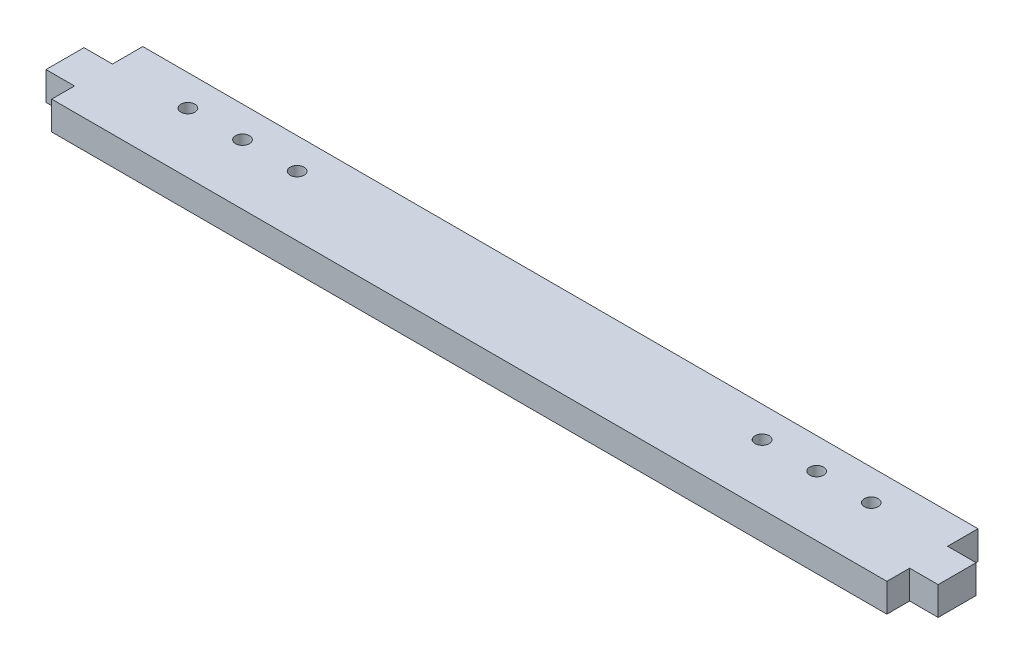
ISO-10303-21;
HEADER;
FILE_DESCRIPTION(('STEP AP214'),'2;1');
FILE_NAME('part.step','',(''),(''),'','','');
FILE_SCHEMA(('AUTOMOTIVE_DESIGN { 1 0 10303 214 1 1 1 1 }'));
ENDSEC;
DATA;
#1=APPLICATION_CONTEXT('core data for automotive mechanical design processes');
#2=APPLICATION_PROTOCOL_DEFINITION('international standard','automotive_design',2000,#1);
#3=PRODUCT_CONTEXT('',#1,'mechanical');
#4=PRODUCT('Part','Part','',(#3));
#5=PRODUCT_RELATED_PRODUCT_CATEGORY('part','',(#4));
#6=PRODUCT_DEFINITION_FORMATION('','',#4);
#7=PRODUCT_DEFINITION_CONTEXT('part definition',#1,'design');
#8=PRODUCT_DEFINITION('design','',#6,#7);
#9=PRODUCT_DEFINITION_SHAPE('','',#8);
#10=(LENGTH_UNIT() NAMED_UNIT(*) SI_UNIT(.MILLI.,.METRE.));
#11=(NAMED_UNIT(*) PLANE_ANGLE_UNIT() SI_UNIT($,.RADIAN.));
#12=(NAMED_UNIT(*) SI_UNIT($,.STERADIAN.) SOLID_ANGLE_UNIT());
#13=UNCERTAINTY_MEASURE_WITH_UNIT(LENGTH_MEASURE(1.E-05),#10,'distance_accuracy_value','');
#14=(GEOMETRIC_REPRESENTATION_CONTEXT(3) GLOBAL_UNCERTAINTY_ASSIGNED_CONTEXT((#13)) GLOBAL_UNIT_ASSIGNED_CONTEXT((#10,
#11,#12)) REPRESENTATION_CONTEXT('',''));
#15=CARTESIAN_POINT('',(0.,0.,0.));
#16=DIRECTION('',(0.,0.,1.));
#17=DIRECTION('',(1.,0.,0.));
#18=AXIS2_PLACEMENT_3D('',#15,#16,#17);
#19=CARTESIAN_POINT('',(-139.7,9.525,15.24));
#20=DIRECTION('',(1.,0.,0.));
#21=DIRECTION('',(0.,0.,-1.));
#22=AXIS2_PLACEMENT_3D('',#19,#20,#21);
#23=PLANE('',#22);
#24=DIRECTION('',(0.,0.,1.));
#25=VECTOR('',#24,1.);
#26=CARTESIAN_POINT('',(-139.7,9.525,15.24));
#27=LINE('',#26,#25);
#28=CARTESIAN_POINT('',(-139.7,9.525,7.61999999999998));
#29=VERTEX_POINT('',#28);
#30=CARTESIAN_POINT('',(-139.7,9.525,15.24));
#31=VERTEX_POINT('',#30);
#32=EDGE_CURVE('E221',#29,#31,#27,.T.);
#33=ORIENTED_EDGE('',*,*,#32,.F.);
#34=DIRECTION('',(0.,-1.,0.));
#35=VECTOR('',#34,1.);
#36=CARTESIAN_POINT('',(-139.7,0.,7.61999999999998));
#37=LINE('',#36,#35);
#38=CARTESIAN_POINT('',(-139.7,0.,7.61999999999998));
#39=VERTEX_POINT('',#38);
#40=EDGE_CURVE('E141',#29,#39,#37,.T.);
#41=ORIENTED_EDGE('',*,*,#40,.T.);
#42=DIRECTION('',(0.,0.,1.));
#43=VECTOR('',#42,1.);
#44=CARTESIAN_POINT('',(-139.7,0.,15.24));
#45=LINE('',#44,#43);
#46=CARTESIAN_POINT('',(-139.7,0.,15.24));
#47=VERTEX_POINT('',#46);
#48=EDGE_CURVE('E216',#39,#47,#45,.T.);
#49=ORIENTED_EDGE('',*,*,#48,.T.);
#50=DIRECTION('',(0.,-1.,0.));
#51=VECTOR('',#50,1.);
#52=CARTESIAN_POINT('',(-139.7,9.525,15.24));
#53=LINE('',#52,#51);
#54=EDGE_CURVE('E11',#31,#47,#53,.T.);
#55=ORIENTED_EDGE('',*,*,#54,.F.);
#56=EDGE_LOOP('',(#33,#41,#49,#55));
#57=FACE_BOUND('',#56,.T.);
#58=ADVANCED_FACE('F43',(#57),#23,.F.);
#59=CARTESIAN_POINT('',(139.7,9.525,15.24));
#60=DIRECTION('',(-1.,0.,0.));
#61=DIRECTION('',(0.,0.,1.));
#62=AXIS2_PLACEMENT_3D('',#59,#60,#61);
#63=PLANE('',#62);
#64=DIRECTION('',(0.,-1.,0.));
#65=VECTOR('',#64,1.);
#66=CARTESIAN_POINT('',(139.7,0.,7.61999999999998));
#67=LINE('',#66,#65);
#68=CARTESIAN_POINT('',(139.7,9.525,7.61999999999999));
#69=VERTEX_POINT('',#68);
#70=CARTESIAN_POINT('',(139.7,0.,7.61999999999999));
#71=VERTEX_POINT('',#70);
#72=EDGE_CURVE('E67',#69,#71,#67,.T.);
#73=ORIENTED_EDGE('',*,*,#72,.F.);
#74=DIRECTION('',(0.,0.,-1.));
#75=VECTOR('',#74,1.);
#76=CARTESIAN_POINT('',(139.7,9.525,15.24));
#77=LINE('',#76,#75);
#78=CARTESIAN_POINT('',(139.7,9.525,15.24));
#79=VERTEX_POINT('',#78);
#80=EDGE_CURVE('E225',#79,#69,#77,.T.);
#81=ORIENTED_EDGE('',*,*,#80,.F.);
#82=DIRECTION('',(0.,-1.,0.));
#83=VECTOR('',#82,1.);
#84=CARTESIAN_POINT('',(139.7,9.525,15.24));
#85=LINE('',#84,#83);
#86=CARTESIAN_POINT('',(139.7,0.,15.24));
#87=VERTEX_POINT('',#86);
#88=EDGE_CURVE('E52',#79,#87,#85,.T.);
#89=ORIENTED_EDGE('',*,*,#88,.T.);
#90=DIRECTION('',(0.,0.,-1.));
#91=VECTOR('',#90,1.);
#92=CARTESIAN_POINT('',(139.7,0.,15.24));
#93=LINE('',#92,#91);
#94=EDGE_CURVE('E240',#87,#71,#93,.T.);
#95=ORIENTED_EDGE('',*,*,#94,.T.);
#96=EDGE_LOOP('',(#73,#81,#89,#95));
#97=FACE_BOUND('',#96,.T.);
#98=ADVANCED_FACE('F256',(#97),#63,.F.);
#99=DIRECTION('',(0.,1.,0.));
#100=VECTOR('',#99,1.);
#101=CARTESIAN_POINT('',(139.7,0.,-5.08000000000002));
#102=LINE('',#101,#100);
#103=CARTESIAN_POINT('',(139.7,0.,-5.08000000000001));
#104=VERTEX_POINT('',#103);
#105=CARTESIAN_POINT('',(139.7,9.525,-5.08000000000002));
#106=VERTEX_POINT('',#105);
#107=EDGE_CURVE('E186',#104,#106,#102,.T.);
#108=ORIENTED_EDGE('',*,*,#107,.F.);
#109=CARTESIAN_POINT('',(139.7,0.,-15.24));
#110=VERTEX_POINT('',#109);
#111=EDGE_CURVE('E239',#104,#110,#93,.T.);
#112=ORIENTED_EDGE('',*,*,#111,.T.);
#113=DIRECTION('',(0.,-1.,0.));
#114=VECTOR('',#113,1.);
#115=CARTESIAN_POINT('',(139.7,9.525,-15.24));
#116=LINE('',#115,#114);
#117=CARTESIAN_POINT('',(139.7,9.525,-15.24));
#118=VERTEX_POINT('',#117);
#119=EDGE_CURVE('E249',#118,#110,#116,.T.);
#120=ORIENTED_EDGE('',*,*,#119,.F.);
#121=EDGE_CURVE('E224',#106,#118,#77,.T.);
#122=ORIENTED_EDGE('',*,*,#121,.F.);
#123=EDGE_LOOP('',(#108,#112,#120,#122));
#124=FACE_BOUND('',#123,.T.);
#125=ADVANCED_FACE('F283',(#124),#63,.F.);
#126=CARTESIAN_POINT('',(-139.7,0.,-15.24));
#127=VERTEX_POINT('',#126);
#128=CARTESIAN_POINT('',(-139.7,0.,-5.08000000000002));
#129=VERTEX_POINT('',#128);
#130=EDGE_CURVE('E232',#127,#129,#45,.T.);
#131=ORIENTED_EDGE('',*,*,#130,.T.);
#132=DIRECTION('',(0.,1.,0.));
#133=VECTOR('',#132,1.);
#134=CARTESIAN_POINT('',(-139.7,0.,-5.08000000000002));
#135=LINE('',#134,#133);
#136=CARTESIAN_POINT('',(-139.7,9.525,-5.08000000000001));
#137=VERTEX_POINT('',#136);
#138=EDGE_CURVE('E155',#129,#137,#135,.T.);
#139=ORIENTED_EDGE('',*,*,#138,.T.);
#140=CARTESIAN_POINT('',(-139.7,9.525,-15.24));
#141=VERTEX_POINT('',#140);
#142=EDGE_CURVE('E217',#141,#137,#27,.T.);
#143=ORIENTED_EDGE('',*,*,#142,.F.);
#144=DIRECTION('',(0.,-1.,0.));
#145=VECTOR('',#144,1.);
#146=CARTESIAN_POINT('',(-139.7,9.525,-15.24));
#147=LINE('',#146,#145);
#148=EDGE_CURVE('E231',#141,#127,#147,.T.);
#149=ORIENTED_EDGE('',*,*,#148,.T.);
#150=EDGE_LOOP('',(#131,#139,#143,#149));
#151=FACE_BOUND('',#150,.T.);
#152=ADVANCED_FACE('F45',(#151),#23,.F.);
#153=CARTESIAN_POINT('',(139.7,9.525,15.24));
#154=DIRECTION('',(0.,0.,-1.));
#155=DIRECTION('',(-1.,0.,0.));
#156=AXIS2_PLACEMENT_3D('',#153,#154,#155);
#157=PLANE('',#156);
#158=DIRECTION('',(1.,0.,0.));
#159=VECTOR('',#158,1.);
#160=CARTESIAN_POINT('',(139.7,0.,15.24));
#161=LINE('',#160,#159);
#162=EDGE_CURVE('E236',#47,#87,#161,.T.);
#163=ORIENTED_EDGE('',*,*,#162,.T.);
#164=ORIENTED_EDGE('',*,*,#88,.F.);
#165=DIRECTION('',(1.,0.,0.));
#166=VECTOR('',#165,1.);
#167=CARTESIAN_POINT('',(139.7,9.525,15.24));
#168=LINE('',#167,#166);
#169=EDGE_CURVE('E220',#31,#79,#168,.T.);
#170=ORIENTED_EDGE('',*,*,#169,.F.);
#171=ORIENTED_EDGE('',*,*,#54,.T.);
#172=EDGE_LOOP('',(#163,#164,#170,#171));
#173=FACE_BOUND('',#172,.T.);
#174=ADVANCED_FACE('F272',(#173),#157,.F.);
#175=CARTESIAN_POINT('',(139.7,9.525,-15.24));
#176=DIRECTION('',(0.,0.,1.));
#177=DIRECTION('',(1.,0.,0.));
#178=AXIS2_PLACEMENT_3D('',#175,#176,#177);
#179=PLANE('',#178);
#180=DIRECTION('',(-1.,0.,0.));
#181=VECTOR('',#180,1.);
#182=CARTESIAN_POINT('',(139.7,0.,-15.24));
#183=LINE('',#182,#181);
#184=EDGE_CURVE('E243',#110,#127,#183,.T.);
#185=ORIENTED_EDGE('',*,*,#184,.T.);
#186=ORIENTED_EDGE('',*,*,#148,.F.);
#187=DIRECTION('',(-1.,0.,0.));
#188=VECTOR('',#187,1.);
#189=CARTESIAN_POINT('',(139.7,9.525,-15.24));
#190=LINE('',#189,#188);
#191=EDGE_CURVE('E228',#118,#141,#190,.T.);
#192=ORIENTED_EDGE('',*,*,#191,.F.);
#193=ORIENTED_EDGE('',*,*,#119,.T.);
#194=EDGE_LOOP('',(#185,#186,#192,#193));
#195=FACE_BOUND('',#194,.T.);
#196=ADVANCED_FACE('F287',(#195),#179,.F.);
#197=CARTESIAN_POINT('',(0.,9.525,0.));
#198=DIRECTION('',(0.,1.,0.));
#199=DIRECTION('',(0.,0.,1.));
#200=AXIS2_PLACEMENT_3D('',#197,#198,#199);
#201=PLANE('',#200);
#202=CARTESIAN_POINT('',(-114.3,9.525,-4.92760000000002));
#203=DIRECTION('',(0.,1.,0.));
#204=DIRECTION('',(0.,0.,-1.));
#205=AXIS2_PLACEMENT_3D('',#202,#203,#204);
#206=CIRCLE('',#205,2.3368);
#207=CARTESIAN_POINT('',(-114.3,9.525,-7.26440000000002));
#208=VERTEX_POINT('',#207);
#209=EDGE_CURVE('E469',#208,#208,#206,.T.);
#210=ORIENTED_EDGE('',*,*,#209,.F.);
#211=EDGE_LOOP('',(#210));
#212=FACE_BOUND('',#211,.T.);
#213=CARTESIAN_POINT('',(-77.7748,9.525,-4.92760000000002));
#214=DIRECTION('',(0.,1.,0.));
#215=DIRECTION('',(0.,0.,-1.));
#216=AXIS2_PLACEMENT_3D('',#213,#214,#215);
#217=CIRCLE('',#216,2.3368);
#218=CARTESIAN_POINT('',(-77.7748,9.525,-7.26440000000002));
#219=VERTEX_POINT('',#218);
#220=EDGE_CURVE('E474',#219,#219,#217,.T.);
#221=ORIENTED_EDGE('',*,*,#220,.F.);
#222=EDGE_LOOP('',(#221));
#223=FACE_BOUND('',#222,.T.);
#224=CARTESIAN_POINT('',(-96.0374,9.525,-4.92760000000002));
#225=DIRECTION('',(0.,1.,0.));
#226=DIRECTION('',(0.,0.,-1.));
#227=AXIS2_PLACEMENT_3D('',#224,#225,#226);
#228=CIRCLE('',#227,2.3368);
#229=CARTESIAN_POINT('',(-96.0374,9.525,-7.26440000000002));
#230=VERTEX_POINT('',#229);
#231=EDGE_CURVE('E487',#230,#230,#228,.T.);
#232=ORIENTED_EDGE('',*,*,#231,.F.);
#233=EDGE_LOOP('',(#232));
#234=FACE_BOUND('',#233,.T.);
#235=CARTESIAN_POINT('',(114.3,9.525,-4.92760000000002));
#236=DIRECTION('',(0.,-1.,0.));
#237=DIRECTION('',(0.,0.,-1.));
#238=AXIS2_PLACEMENT_3D('',#235,#236,#237);
#239=CIRCLE('',#238,2.3368);
#240=CARTESIAN_POINT('',(114.3,9.525,-7.26440000000002));
#241=VERTEX_POINT('',#240);
#242=EDGE_CURVE('E171',#241,#241,#239,.T.);
#243=ORIENTED_EDGE('',*,*,#242,.T.);
#244=EDGE_LOOP('',(#243));
#245=FACE_BOUND('',#244,.T.);
#246=CARTESIAN_POINT('',(77.7748,9.525,-4.92760000000002));
#247=DIRECTION('',(0.,-1.,0.));
#248=DIRECTION('',(0.,0.,-1.));
#249=AXIS2_PLACEMENT_3D('',#246,#247,#248);
#250=CIRCLE('',#249,2.3368);
#251=CARTESIAN_POINT('',(77.7748,9.525,-7.26440000000002));
#252=VERTEX_POINT('',#251);
#253=EDGE_CURVE('E506',#252,#252,#250,.T.);
#254=ORIENTED_EDGE('',*,*,#253,.T.);
#255=EDGE_LOOP('',(#254));
#256=FACE_BOUND('',#255,.T.);
#257=CARTESIAN_POINT('',(96.0374,9.525,-4.92760000000002));
#258=DIRECTION('',(0.,-1.,0.));
#259=DIRECTION('',(0.,0.,-1.));
#260=AXIS2_PLACEMENT_3D('',#257,#258,#259);
#261=CIRCLE('',#260,2.3368);
#262=CARTESIAN_POINT('',(96.0374,9.525,-7.26440000000002));
#263=VERTEX_POINT('',#262);
#264=EDGE_CURVE('E478',#263,#263,#261,.T.);
#265=ORIENTED_EDGE('',*,*,#264,.T.);
#266=EDGE_LOOP('',(#265));
#267=FACE_BOUND('',#266,.T.);
#268=ORIENTED_EDGE('',*,*,#142,.T.);
#269=DIRECTION('',(1.,0.,0.));
#270=VECTOR('',#269,1.);
#271=CARTESIAN_POINT('',(-149.225,9.525,-5.08000000000002));
#272=LINE('',#271,#270);
#273=CARTESIAN_POINT('',(-149.225,9.525,-5.08000000000002));
#274=VERTEX_POINT('',#273);
#275=EDGE_CURVE('E59',#274,#137,#272,.T.);
#276=ORIENTED_EDGE('',*,*,#275,.F.);
#277=DIRECTION('',(0.,0.,1.));
#278=VECTOR('',#277,1.);
#279=CARTESIAN_POINT('',(-149.225,9.525,7.61999999999998));
#280=LINE('',#279,#278);
#281=CARTESIAN_POINT('',(-149.225,9.525,7.61999999999998));
#282=VERTEX_POINT('',#281);
#283=EDGE_CURVE('E151',#274,#282,#280,.T.);
#284=ORIENTED_EDGE('',*,*,#283,.T.);
#285=DIRECTION('',(1.,0.,0.));
#286=VECTOR('',#285,1.);
#287=CARTESIAN_POINT('',(-149.225,9.525,7.61999999999998));
#288=LINE('',#287,#286);
#289=EDGE_CURVE('E135',#282,#29,#288,.T.);
#290=ORIENTED_EDGE('',*,*,#289,.T.);
#291=ORIENTED_EDGE('',*,*,#32,.T.);
#292=ORIENTED_EDGE('',*,*,#169,.T.);
#293=ORIENTED_EDGE('',*,*,#80,.T.);
#294=DIRECTION('',(-1.,0.,0.));
#295=VECTOR('',#294,1.);
#296=CARTESIAN_POINT('',(149.225,9.525,7.61999999999998));
#297=LINE('',#296,#295);
#298=CARTESIAN_POINT('',(149.225,9.525,7.61999999999998));
#299=VERTEX_POINT('',#298);
#300=EDGE_CURVE('E195',#299,#69,#297,.T.);
#301=ORIENTED_EDGE('',*,*,#300,.F.);
#302=DIRECTION('',(0.,0.,1.));
#303=VECTOR('',#302,1.);
#304=CARTESIAN_POINT('',(149.225,9.525,7.61999999999998));
#305=LINE('',#304,#303);
#306=CARTESIAN_POINT('',(149.225,9.525,-5.08000000000002));
#307=VERTEX_POINT('',#306);
#308=EDGE_CURVE('E192',#307,#299,#305,.T.);
#309=ORIENTED_EDGE('',*,*,#308,.F.);
#310=DIRECTION('',(-1.,0.,0.));
#311=VECTOR('',#310,1.);
#312=CARTESIAN_POINT('',(149.225,9.525,-5.08000000000002));
#313=LINE('',#312,#311);
#314=EDGE_CURVE('E204',#307,#106,#313,.T.);
#315=ORIENTED_EDGE('',*,*,#314,.T.);
#316=ORIENTED_EDGE('',*,*,#121,.T.);
#317=ORIENTED_EDGE('',*,*,#191,.T.);
#318=EDGE_LOOP('',(#268,#276,#284,#290,#291,#292,#293,#301,#309,#315,#316,#317));
#319=FACE_BOUND('',#318,.T.);
#320=ADVANCED_FACE('F158',(#212,#223,#234,#245,#256,#267,#319),#201,.T.);
#321=CARTESIAN_POINT('',(0.,0.,0.));
#322=DIRECTION('',(0.,1.,0.));
#323=DIRECTION('',(0.,0.,1.));
#324=AXIS2_PLACEMENT_3D('',#321,#322,#323);
#325=PLANE('',#324);
#326=CARTESIAN_POINT('',(-114.3,0.,-4.92760000000002));
#327=DIRECTION('',(0.,1.,0.));
#328=DIRECTION('',(0.,0.,-1.));
#329=AXIS2_PLACEMENT_3D('',#326,#327,#328);
#330=CIRCLE('',#329,2.3368);
#331=CARTESIAN_POINT('',(-114.3,0.,-7.26440000000002));
#332=VERTEX_POINT('',#331);
#333=EDGE_CURVE('E472',#332,#332,#330,.T.);
#334=ORIENTED_EDGE('',*,*,#333,.T.);
#335=EDGE_LOOP('',(#334));
#336=FACE_BOUND('',#335,.T.);
#337=CARTESIAN_POINT('',(-77.7748,0.,-4.92760000000002));
#338=DIRECTION('',(0.,1.,0.));
#339=DIRECTION('',(0.,0.,-1.));
#340=AXIS2_PLACEMENT_3D('',#337,#338,#339);
#341=CIRCLE('',#340,2.3368);
#342=CARTESIAN_POINT('',(-77.7748,0.,-7.26440000000002));
#343=VERTEX_POINT('',#342);
#344=EDGE_CURVE('E481',#343,#343,#341,.T.);
#345=ORIENTED_EDGE('',*,*,#344,.T.);
#346=EDGE_LOOP('',(#345));
#347=FACE_BOUND('',#346,.T.);
#348=CARTESIAN_POINT('',(-96.0374,0.,-4.92760000000002));
#349=DIRECTION('',(0.,1.,0.));
#350=DIRECTION('',(0.,0.,-1.));
#351=AXIS2_PLACEMENT_3D('',#348,#349,#350);
#352=CIRCLE('',#351,2.3368);
#353=CARTESIAN_POINT('',(-96.0374,0.,-7.26440000000002));
#354=VERTEX_POINT('',#353);
#355=EDGE_CURVE('E491',#354,#354,#352,.T.);
#356=ORIENTED_EDGE('',*,*,#355,.T.);
#357=EDGE_LOOP('',(#356));
#358=FACE_BOUND('',#357,.T.);
#359=CARTESIAN_POINT('',(114.3,0.,-4.92760000000002));
#360=DIRECTION('',(0.,-1.,0.));
#361=DIRECTION('',(0.,0.,-1.));
#362=AXIS2_PLACEMENT_3D('',#359,#360,#361);
#363=CIRCLE('',#362,2.3368);
#364=CARTESIAN_POINT('',(114.3,0.,-7.26440000000002));
#365=VERTEX_POINT('',#364);
#366=EDGE_CURVE('E498',#365,#365,#363,.T.);
#367=ORIENTED_EDGE('',*,*,#366,.F.);
#368=EDGE_LOOP('',(#367));
#369=FACE_BOUND('',#368,.T.);
#370=CARTESIAN_POINT('',(77.7748,0.,-4.92760000000002));
#371=DIRECTION('',(0.,-1.,0.));
#372=DIRECTION('',(0.,0.,-1.));
#373=AXIS2_PLACEMENT_3D('',#370,#371,#372);
#374=CIRCLE('',#373,2.3368);
#375=CARTESIAN_POINT('',(77.7748,0.,-7.26440000000002));
#376=VERTEX_POINT('',#375);
#377=EDGE_CURVE('E502',#376,#376,#374,.T.);
#378=ORIENTED_EDGE('',*,*,#377,.F.);
#379=EDGE_LOOP('',(#378));
#380=FACE_BOUND('',#379,.T.);
#381=CARTESIAN_POINT('',(96.0374,0.,-4.92760000000002));
#382=DIRECTION('',(0.,-1.,0.));
#383=DIRECTION('',(0.,0.,-1.));
#384=AXIS2_PLACEMENT_3D('',#381,#382,#383);
#385=CIRCLE('',#384,2.3368);
#386=CARTESIAN_POINT('',(96.0374,0.,-7.26440000000002));
#387=VERTEX_POINT('',#386);
#388=EDGE_CURVE('E510',#387,#387,#385,.T.);
#389=ORIENTED_EDGE('',*,*,#388,.F.);
#390=EDGE_LOOP('',(#389));
#391=FACE_BOUND('',#390,.T.);
#392=ORIENTED_EDGE('',*,*,#130,.F.);
#393=ORIENTED_EDGE('',*,*,#184,.F.);
#394=ORIENTED_EDGE('',*,*,#111,.F.);
#395=DIRECTION('',(-1.,0.,0.));
#396=VECTOR('',#395,1.);
#397=CARTESIAN_POINT('',(149.225,0.,-5.08000000000002));
#398=LINE('',#397,#396);
#399=CARTESIAN_POINT('',(149.225,0.,-5.08000000000002));
#400=VERTEX_POINT('',#399);
#401=EDGE_CURVE('E208',#400,#104,#398,.T.);
#402=ORIENTED_EDGE('',*,*,#401,.F.);
#403=DIRECTION('',(0.,0.,-1.));
#404=VECTOR('',#403,1.);
#405=CARTESIAN_POINT('',(149.225,0.,7.61999999999998));
#406=LINE('',#405,#404);
#407=CARTESIAN_POINT('',(149.225,0.,7.61999999999998));
#408=VERTEX_POINT('',#407);
#409=EDGE_CURVE('E185',#408,#400,#406,.T.);
#410=ORIENTED_EDGE('',*,*,#409,.F.);
#411=DIRECTION('',(-1.,0.,0.));
#412=VECTOR('',#411,1.);
#413=CARTESIAN_POINT('',(149.225,0.,7.61999999999998));
#414=LINE('',#413,#412);
#415=EDGE_CURVE('E212',#408,#71,#414,.T.);
#416=ORIENTED_EDGE('',*,*,#415,.T.);
#417=ORIENTED_EDGE('',*,*,#94,.F.);
#418=ORIENTED_EDGE('',*,*,#162,.F.);
#419=ORIENTED_EDGE('',*,*,#48,.F.);
#420=DIRECTION('',(1.,0.,0.));
#421=VECTOR('',#420,1.);
#422=CARTESIAN_POINT('',(-149.225,0.,7.61999999999998));
#423=LINE('',#422,#421);
#424=CARTESIAN_POINT('',(-149.225,0.,7.61999999999998));
#425=VERTEX_POINT('',#424);
#426=EDGE_CURVE('E168',#425,#39,#423,.T.);
#427=ORIENTED_EDGE('',*,*,#426,.F.);
#428=DIRECTION('',(0.,0.,-1.));
#429=VECTOR('',#428,1.);
#430=CARTESIAN_POINT('',(-149.225,0.,7.61999999999998));
#431=LINE('',#430,#429);
#432=CARTESIAN_POINT('',(-149.225,0.,-5.08000000000002));
#433=VERTEX_POINT('',#432);
#434=EDGE_CURVE('E153',#425,#433,#431,.T.);
#435=ORIENTED_EDGE('',*,*,#434,.T.);
#436=DIRECTION('',(1.,0.,0.));
#437=VECTOR('',#436,1.);
#438=CARTESIAN_POINT('',(-149.225,0.,-5.08000000000002));
#439=LINE('',#438,#437);
#440=EDGE_CURVE('E176',#433,#129,#439,.T.);
#441=ORIENTED_EDGE('',*,*,#440,.T.);
#442=EDGE_LOOP('',(#392,#393,#394,#402,#410,#416,#417,#418,#419,#427,#435,#441));
#443=FACE_BOUND('',#442,.T.);
#444=ADVANCED_FACE('F262',(#336,#347,#358,#369,#380,#391,#443),#325,.F.);
#445=CARTESIAN_POINT('',(149.225,0.,7.61999999999998));
#446=DIRECTION('',(0.,0.,-1.));
#447=DIRECTION('',(-1.,0.,0.));
#448=AXIS2_PLACEMENT_3D('',#445,#446,#447);
#449=PLANE('',#448);
#450=ORIENTED_EDGE('',*,*,#72,.T.);
#451=ORIENTED_EDGE('',*,*,#415,.F.);
#452=DIRECTION('',(0.,-1.,0.));
#453=VECTOR('',#452,1.);
#454=CARTESIAN_POINT('',(149.225,0.,7.61999999999998));
#455=LINE('',#454,#453);
#456=EDGE_CURVE('E181',#299,#408,#455,.T.);
#457=ORIENTED_EDGE('',*,*,#456,.F.);
#458=ORIENTED_EDGE('',*,*,#300,.T.);
#459=EDGE_LOOP('',(#450,#451,#457,#458));
#460=FACE_BOUND('',#459,.T.);
#461=ADVANCED_FACE('F268',(#460),#449,.F.);
#462=CARTESIAN_POINT('',(149.225,0.,-5.08000000000002));
#463=DIRECTION('',(0.,0.,1.));
#464=DIRECTION('',(0.,-1.,0.));
#465=AXIS2_PLACEMENT_3D('',#462,#463,#464);
#466=PLANE('',#465);
#467=ORIENTED_EDGE('',*,*,#107,.T.);
#468=ORIENTED_EDGE('',*,*,#314,.F.);
#469=DIRECTION('',(0.,1.,0.));
#470=VECTOR('',#469,1.);
#471=CARTESIAN_POINT('',(149.225,0.,-5.08000000000002));
#472=LINE('',#471,#470);
#473=EDGE_CURVE('E189',#400,#307,#472,.T.);
#474=ORIENTED_EDGE('',*,*,#473,.F.);
#475=ORIENTED_EDGE('',*,*,#401,.T.);
#476=EDGE_LOOP('',(#467,#468,#474,#475));
#477=FACE_BOUND('',#476,.T.);
#478=ADVANCED_FACE('F293',(#477),#466,.F.);
#479=CARTESIAN_POINT('',(149.225,0.,0.));
#480=DIRECTION('',(-1.,0.,0.));
#481=DIRECTION('',(0.,0.,1.));
#482=AXIS2_PLACEMENT_3D('',#479,#480,#481);
#483=PLANE('',#482);
#484=ORIENTED_EDGE('',*,*,#456,.T.);
#485=ORIENTED_EDGE('',*,*,#409,.T.);
#486=ORIENTED_EDGE('',*,*,#473,.T.);
#487=ORIENTED_EDGE('',*,*,#308,.T.);
#488=EDGE_LOOP('',(#484,#485,#486,#487));
#489=FACE_BOUND('',#488,.T.);
#490=ADVANCED_FACE('F295',(#489),#483,.F.);
#491=CARTESIAN_POINT('',(-149.225,0.,7.61999999999998));
#492=DIRECTION('',(0.,0.,1.));
#493=DIRECTION('',(1.,0.,0.));
#494=AXIS2_PLACEMENT_3D('',#491,#492,#493);
#495=PLANE('',#494);
#496=ORIENTED_EDGE('',*,*,#40,.F.);
#497=ORIENTED_EDGE('',*,*,#289,.F.);
#498=DIRECTION('',(0.,-1.,0.));
#499=VECTOR('',#498,1.);
#500=CARTESIAN_POINT('',(-149.225,0.,7.61999999999998));
#501=LINE('',#500,#499);
#502=EDGE_CURVE('E138',#282,#425,#501,.T.);
#503=ORIENTED_EDGE('',*,*,#502,.T.);
#504=ORIENTED_EDGE('',*,*,#426,.T.);
#505=EDGE_LOOP('',(#496,#497,#503,#504));
#506=FACE_BOUND('',#505,.T.);
#507=ADVANCED_FACE('F137',(#506),#495,.T.);
#508=CARTESIAN_POINT('',(-149.225,0.,-5.08000000000002));
#509=DIRECTION('',(0.,0.,-1.));
#510=DIRECTION('',(0.,1.,0.));
#511=AXIS2_PLACEMENT_3D('',#508,#509,#510);
#512=PLANE('',#511);
#513=ORIENTED_EDGE('',*,*,#138,.F.);
#514=ORIENTED_EDGE('',*,*,#440,.F.);
#515=DIRECTION('',(0.,1.,0.));
#516=VECTOR('',#515,1.);
#517=CARTESIAN_POINT('',(-149.225,0.,-5.08000000000002));
#518=LINE('',#517,#516);
#519=EDGE_CURVE('E160',#433,#274,#518,.T.);
#520=ORIENTED_EDGE('',*,*,#519,.T.);
#521=ORIENTED_EDGE('',*,*,#275,.T.);
#522=EDGE_LOOP('',(#513,#514,#520,#521));
#523=FACE_BOUND('',#522,.T.);
#524=ADVANCED_FACE('F290',(#523),#512,.T.);
#525=CARTESIAN_POINT('',(-149.225,0.,0.));
#526=DIRECTION('',(1.,0.,0.));
#527=DIRECTION('',(0.,0.,1.));
#528=AXIS2_PLACEMENT_3D('',#525,#526,#527);
#529=PLANE('',#528);
#530=ORIENTED_EDGE('',*,*,#502,.F.);
#531=ORIENTED_EDGE('',*,*,#283,.F.);
#532=ORIENTED_EDGE('',*,*,#519,.F.);
#533=ORIENTED_EDGE('',*,*,#434,.F.);
#534=EDGE_LOOP('',(#530,#531,#532,#533));
#535=FACE_BOUND('',#534,.T.);
#536=ADVANCED_FACE('F149',(#535),#529,.F.);
#537=CARTESIAN_POINT('',(96.0374,9.525,-4.92760000000002));
#538=DIRECTION('',(0.,-1.,0.));
#539=DIRECTION('',(0.,0.,-1.));
#540=AXIS2_PLACEMENT_3D('',#537,#538,#539);
#541=CYLINDRICAL_SURFACE('',#540,2.3368);
#542=ORIENTED_EDGE('',*,*,#264,.F.);
#543=EDGE_LOOP('',(#542));
#544=FACE_BOUND('',#543,.T.);
#545=ORIENTED_EDGE('',*,*,#388,.T.);
#546=EDGE_LOOP('',(#545));
#547=FACE_BOUND('',#546,.T.);
#548=ADVANCED_FACE('F376',(#544,#547),#541,.F.);
#549=CARTESIAN_POINT('',(77.7748,9.525,-4.92760000000002));
#550=DIRECTION('',(0.,-1.,0.));
#551=DIRECTION('',(0.,0.,-1.));
#552=AXIS2_PLACEMENT_3D('',#549,#550,#551);
#553=CYLINDRICAL_SURFACE('',#552,2.3368);
#554=ORIENTED_EDGE('',*,*,#253,.F.);
#555=EDGE_LOOP('',(#554));
#556=FACE_BOUND('',#555,.T.);
#557=ORIENTED_EDGE('',*,*,#377,.T.);
#558=EDGE_LOOP('',(#557));
#559=FACE_BOUND('',#558,.T.);
#560=ADVANCED_FACE('F386',(#556,#559),#553,.F.);
#561=CARTESIAN_POINT('',(114.3,9.525,-4.92760000000002));
#562=DIRECTION('',(0.,-1.,0.));
#563=DIRECTION('',(0.,0.,-1.));
#564=AXIS2_PLACEMENT_3D('',#561,#562,#563);
#565=CYLINDRICAL_SURFACE('',#564,2.3368);
#566=ORIENTED_EDGE('',*,*,#242,.F.);
#567=EDGE_LOOP('',(#566));
#568=FACE_BOUND('',#567,.T.);
#569=ORIENTED_EDGE('',*,*,#366,.T.);
#570=EDGE_LOOP('',(#569));
#571=FACE_BOUND('',#570,.T.);
#572=ADVANCED_FACE('F397',(#568,#571),#565,.F.);
#573=CARTESIAN_POINT('',(-96.0374,9.525,-4.92760000000002));
#574=DIRECTION('',(0.,-1.,0.));
#575=DIRECTION('',(0.,0.,-1.));
#576=AXIS2_PLACEMENT_3D('',#573,#574,#575);
#577=CYLINDRICAL_SURFACE('',#576,2.3368);
#578=ORIENTED_EDGE('',*,*,#231,.T.);
#579=EDGE_LOOP('',(#578));
#580=FACE_BOUND('',#579,.T.);
#581=ORIENTED_EDGE('',*,*,#355,.F.);
#582=EDGE_LOOP('',(#581));
#583=FACE_BOUND('',#582,.T.);
#584=ADVANCED_FACE('F408',(#580,#583),#577,.F.);
#585=CARTESIAN_POINT('',(-77.7748,9.525,-4.92760000000002));
#586=DIRECTION('',(0.,-1.,0.));
#587=DIRECTION('',(0.,0.,-1.));
#588=AXIS2_PLACEMENT_3D('',#585,#586,#587);
#589=CYLINDRICAL_SURFACE('',#588,2.3368);
#590=ORIENTED_EDGE('',*,*,#220,.T.);
#591=EDGE_LOOP('',(#590));
#592=FACE_BOUND('',#591,.T.);
#593=ORIENTED_EDGE('',*,*,#344,.F.);
#594=EDGE_LOOP('',(#593));
#595=FACE_BOUND('',#594,.T.);
#596=ADVANCED_FACE('F430',(#592,#595),#589,.F.);
#597=CARTESIAN_POINT('',(-114.3,9.525,-4.92760000000002));
#598=DIRECTION('',(0.,-1.,0.));
#599=DIRECTION('',(0.,0.,-1.));
#600=AXIS2_PLACEMENT_3D('',#597,#598,#599);
#601=CYLINDRICAL_SURFACE('',#600,2.3368);
#602=ORIENTED_EDGE('',*,*,#209,.T.);
#603=EDGE_LOOP('',(#602));
#604=FACE_BOUND('',#603,.T.);
#605=ORIENTED_EDGE('',*,*,#333,.F.);
#606=EDGE_LOOP('',(#605));
#607=FACE_BOUND('',#606,.T.);
#608=ADVANCED_FACE('F441',(#604,#607),#601,.F.);
#609=CLOSED_SHELL('',(#58,#98,#125,#152,#174,#196,#320,#444,#461,#478,#490,#507,#524,#536,#548,
#560,#572,#584,#596,#608));
#610=MANIFOLD_SOLID_BREP('B2',#609);
#611=ADVANCED_BREP_SHAPE_REPRESENTATION('',(#18,#610),#14);
#612=SHAPE_DEFINITION_REPRESENTATION(#9,#611);
ENDSEC;
END-ISO-10303-21;
